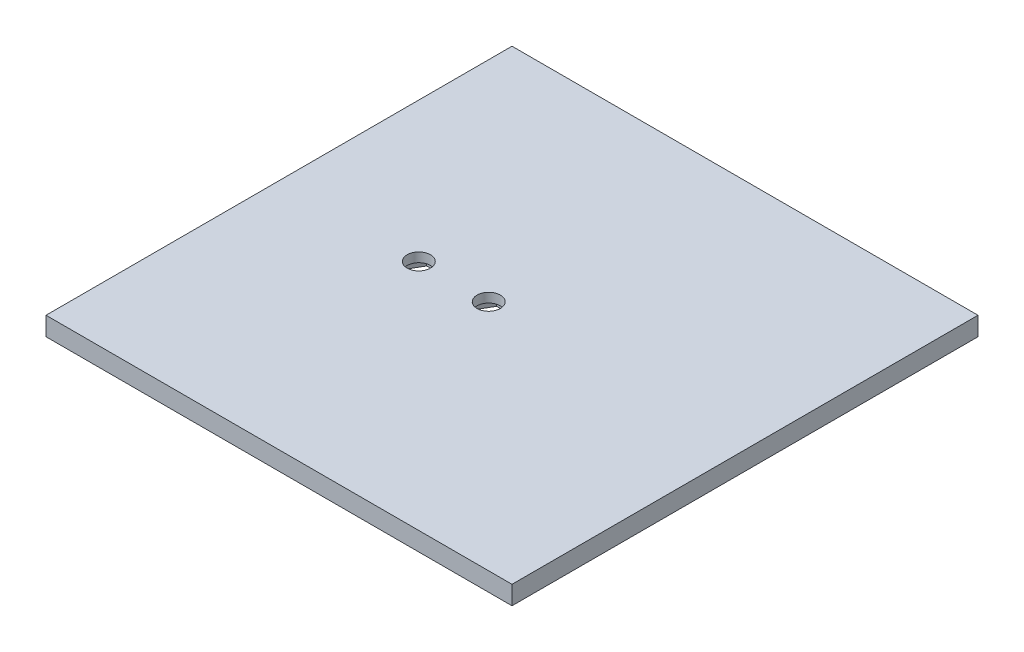
ISO-10303-21;
HEADER;
FILE_DESCRIPTION(('STEP AP214'),'2;1');
FILE_NAME('part.step','',(''),(''),'','','');
FILE_SCHEMA(('AUTOMOTIVE_DESIGN { 1 0 10303 214 1 1 1 1 }'));
ENDSEC;
DATA;
#1=APPLICATION_CONTEXT('core data for automotive mechanical design processes');
#2=APPLICATION_PROTOCOL_DEFINITION('international standard','automotive_design',2000,#1);
#3=PRODUCT_CONTEXT('',#1,'mechanical');
#4=PRODUCT('Part','Part','',(#3));
#5=PRODUCT_RELATED_PRODUCT_CATEGORY('part','',(#4));
#6=PRODUCT_DEFINITION_FORMATION('','',#4);
#7=PRODUCT_DEFINITION_CONTEXT('part definition',#1,'design');
#8=PRODUCT_DEFINITION('design','',#6,#7);
#9=PRODUCT_DEFINITION_SHAPE('','',#8);
#10=(LENGTH_UNIT() NAMED_UNIT(*) SI_UNIT(.MILLI.,.METRE.));
#11=(NAMED_UNIT(*) PLANE_ANGLE_UNIT() SI_UNIT($,.RADIAN.));
#12=(NAMED_UNIT(*) SI_UNIT($,.STERADIAN.) SOLID_ANGLE_UNIT());
#13=UNCERTAINTY_MEASURE_WITH_UNIT(LENGTH_MEASURE(1.E-05),#10,'distance_accuracy_value','');
#14=(GEOMETRIC_REPRESENTATION_CONTEXT(3) GLOBAL_UNCERTAINTY_ASSIGNED_CONTEXT((#13)) GLOBAL_UNIT_ASSIGNED_CONTEXT((#10,
#11,#12)) REPRESENTATION_CONTEXT('',''));
#15=CARTESIAN_POINT('',(0.,0.,0.));
#16=DIRECTION('',(0.,0.,1.));
#17=DIRECTION('',(1.,0.,0.));
#18=AXIS2_PLACEMENT_3D('',#15,#16,#17);
#19=CARTESIAN_POINT('',(-34.8765432098765,4.,-23.5339506172839));
#20=DIRECTION('',(1.,0.,0.));
#21=DIRECTION('',(0.,0.,-1.));
#22=AXIS2_PLACEMENT_3D('',#19,#20,#21);
#23=PLANE('',#22);
#24=DIRECTION('',(0.,0.,1.));
#25=VECTOR('',#24,1.);
#26=CARTESIAN_POINT('',(-34.8765432098765,0.,-23.5339506172839));
#27=LINE('',#26,#25);
#28=CARTESIAN_POINT('',(-34.8765432098765,0.,-23.5339506172839));
#29=VERTEX_POINT('',#28);
#30=CARTESIAN_POINT('',(-34.8765432098765,0.,76.4660493827161));
#31=VERTEX_POINT('',#30);
#32=EDGE_CURVE('E302',#29,#31,#27,.T.);
#33=ORIENTED_EDGE('',*,*,#32,.T.);
#34=DIRECTION('',(0.,-1.,0.));
#35=VECTOR('',#34,1.);
#36=CARTESIAN_POINT('',(-34.8765432098765,4.,76.4660493827161));
#37=LINE('',#36,#35);
#38=CARTESIAN_POINT('',(-34.8765432098765,4.,76.4660493827161));
#39=VERTEX_POINT('',#38);
#40=EDGE_CURVE('E11',#39,#31,#37,.T.);
#41=ORIENTED_EDGE('',*,*,#40,.F.);
#42=DIRECTION('',(0.,0.,1.));
#43=VECTOR('',#42,1.);
#44=CARTESIAN_POINT('',(-34.8765432098765,4.,-23.5339506172839));
#45=LINE('',#44,#43);
#46=CARTESIAN_POINT('',(-34.8765432098765,4.,-23.5339506172839));
#47=VERTEX_POINT('',#46);
#48=EDGE_CURVE('E310',#47,#39,#45,.T.);
#49=ORIENTED_EDGE('',*,*,#48,.F.);
#50=DIRECTION('',(0.,-1.,0.));
#51=VECTOR('',#50,1.);
#52=CARTESIAN_POINT('',(-34.8765432098765,4.,-23.5339506172839));
#53=LINE('',#52,#51);
#54=EDGE_CURVE('E324',#47,#29,#53,.T.);
#55=ORIENTED_EDGE('',*,*,#54,.T.);
#56=EDGE_LOOP('',(#33,#41,#49,#55));
#57=FACE_BOUND('',#56,.T.);
#58=ADVANCED_FACE('F43',(#57),#23,.F.);
#59=CARTESIAN_POINT('',(-34.8765432098765,4.,76.4660493827161));
#60=DIRECTION('',(0.,0.,-1.));
#61=DIRECTION('',(-1.,0.,0.));
#62=AXIS2_PLACEMENT_3D('',#59,#60,#61);
#63=PLANE('',#62);
#64=DIRECTION('',(1.,0.,0.));
#65=VECTOR('',#64,1.);
#66=CARTESIAN_POINT('',(-34.8765432098765,0.,76.4660493827161));
#67=LINE('',#66,#65);
#68=CARTESIAN_POINT('',(65.1234567901235,0.,76.4660493827161));
#69=VERTEX_POINT('',#68);
#70=EDGE_CURVE('E328',#31,#69,#67,.T.);
#71=ORIENTED_EDGE('',*,*,#70,.T.);
#72=DIRECTION('',(0.,-1.,0.));
#73=VECTOR('',#72,1.);
#74=CARTESIAN_POINT('',(65.1234567901235,4.,76.4660493827161));
#75=LINE('',#74,#73);
#76=CARTESIAN_POINT('',(65.1234567901235,4.,76.4660493827161));
#77=VERTEX_POINT('',#76);
#78=EDGE_CURVE('E51',#77,#69,#75,.T.);
#79=ORIENTED_EDGE('',*,*,#78,.F.);
#80=DIRECTION('',(1.,0.,0.));
#81=VECTOR('',#80,1.);
#82=CARTESIAN_POINT('',(-34.8765432098765,4.,76.4660493827161));
#83=LINE('',#82,#81);
#84=EDGE_CURVE('E314',#39,#77,#83,.T.);
#85=ORIENTED_EDGE('',*,*,#84,.F.);
#86=ORIENTED_EDGE('',*,*,#40,.T.);
#87=EDGE_LOOP('',(#71,#79,#85,#86));
#88=FACE_BOUND('',#87,.T.);
#89=ADVANCED_FACE('F364',(#88),#63,.F.);
#90=CARTESIAN_POINT('',(65.1234567901235,4.,-23.5339506172839));
#91=DIRECTION('',(-1.,0.,0.));
#92=DIRECTION('',(0.,0.,1.));
#93=AXIS2_PLACEMENT_3D('',#90,#91,#92);
#94=PLANE('',#93);
#95=DIRECTION('',(0.,0.,-1.));
#96=VECTOR('',#95,1.);
#97=CARTESIAN_POINT('',(65.1234567901235,0.,-23.5339506172839));
#98=LINE('',#97,#96);
#99=CARTESIAN_POINT('',(65.1234567901235,0.,-23.5339506172839));
#100=VERTEX_POINT('',#99);
#101=EDGE_CURVE('E331',#69,#100,#98,.T.);
#102=ORIENTED_EDGE('',*,*,#101,.T.);
#103=DIRECTION('',(0.,-1.,0.));
#104=VECTOR('',#103,1.);
#105=CARTESIAN_POINT('',(65.1234567901235,4.,-23.5339506172839));
#106=LINE('',#105,#104);
#107=CARTESIAN_POINT('',(65.1234567901235,4.,-23.5339506172839));
#108=VERTEX_POINT('',#107);
#109=EDGE_CURVE('E339',#108,#100,#106,.T.);
#110=ORIENTED_EDGE('',*,*,#109,.F.);
#111=DIRECTION('',(0.,0.,-1.));
#112=VECTOR('',#111,1.);
#113=CARTESIAN_POINT('',(65.1234567901235,4.,-23.5339506172839));
#114=LINE('',#113,#112);
#115=EDGE_CURVE('E318',#77,#108,#114,.T.);
#116=ORIENTED_EDGE('',*,*,#115,.F.);
#117=ORIENTED_EDGE('',*,*,#78,.T.);
#118=EDGE_LOOP('',(#102,#110,#116,#117));
#119=FACE_BOUND('',#118,.T.);
#120=ADVANCED_FACE('F348',(#119),#94,.F.);
#121=CARTESIAN_POINT('',(-34.8765432098765,4.,-23.5339506172839));
#122=DIRECTION('',(0.,0.,1.));
#123=DIRECTION('',(1.,0.,0.));
#124=AXIS2_PLACEMENT_3D('',#121,#122,#123);
#125=PLANE('',#124);
#126=DIRECTION('',(-1.,0.,0.));
#127=VECTOR('',#126,1.);
#128=CARTESIAN_POINT('',(-34.8765432098765,0.,-23.5339506172839));
#129=LINE('',#128,#127);
#130=EDGE_CURVE('E315',#100,#29,#129,.T.);
#131=ORIENTED_EDGE('',*,*,#130,.T.);
#132=ORIENTED_EDGE('',*,*,#54,.F.);
#133=DIRECTION('',(-1.,0.,0.));
#134=VECTOR('',#133,1.);
#135=CARTESIAN_POINT('',(-34.8765432098765,4.,-23.5339506172839));
#136=LINE('',#135,#134);
#137=EDGE_CURVE('E321',#108,#47,#136,.T.);
#138=ORIENTED_EDGE('',*,*,#137,.F.);
#139=ORIENTED_EDGE('',*,*,#109,.T.);
#140=EDGE_LOOP('',(#131,#132,#138,#139));
#141=FACE_BOUND('',#140,.T.);
#142=ADVANCED_FACE('F357',(#141),#125,.F.);
#143=CARTESIAN_POINT('',(0.,4.,0.));
#144=DIRECTION('',(0.,1.,0.));
#145=DIRECTION('',(0.,0.,1.));
#146=AXIS2_PLACEMENT_3D('',#143,#144,#145);
#147=PLANE('',#146);
#148=CARTESIAN_POINT('',(10.1234567901235,4.,26.4660493827161));
#149=DIRECTION('',(0.,1.,0.));
#150=DIRECTION('',(0.,0.,1.));
#151=AXIS2_PLACEMENT_3D('',#148,#149,#150);
#152=CIRCLE('',#151,2.5);
#153=CARTESIAN_POINT('',(10.1234567901235,4.,28.9660493827161));
#154=VERTEX_POINT('',#153);
#155=EDGE_CURVE('E298',#154,#154,#152,.T.);
#156=ORIENTED_EDGE('',*,*,#155,.F.);
#157=EDGE_LOOP('',(#156));
#158=FACE_BOUND('',#157,.T.);
#159=CARTESIAN_POINT('',(-4.87654320987654,4.,26.4660493827161));
#160=DIRECTION('',(0.,1.,0.));
#161=DIRECTION('',(0.,0.,1.));
#162=AXIS2_PLACEMENT_3D('',#159,#160,#161);
#163=CIRCLE('',#162,2.5);
#164=CARTESIAN_POINT('',(-4.87654320987654,4.,28.9660493827161));
#165=VERTEX_POINT('',#164);
#166=EDGE_CURVE('E303',#165,#165,#163,.T.);
#167=ORIENTED_EDGE('',*,*,#166,.F.);
#168=EDGE_LOOP('',(#167));
#169=FACE_BOUND('',#168,.T.);
#170=ORIENTED_EDGE('',*,*,#48,.T.);
#171=ORIENTED_EDGE('',*,*,#84,.T.);
#172=ORIENTED_EDGE('',*,*,#115,.T.);
#173=ORIENTED_EDGE('',*,*,#137,.T.);
#174=EDGE_LOOP('',(#170,#171,#172,#173));
#175=FACE_BOUND('',#174,.T.);
#176=ADVANCED_FACE('F363',(#158,#169,#175),#147,.T.);
#177=CARTESIAN_POINT('',(0.,0.,0.));
#178=DIRECTION('',(0.,1.,0.));
#179=DIRECTION('',(0.,0.,1.));
#180=AXIS2_PLACEMENT_3D('',#177,#178,#179);
#181=PLANE('',#180);
#182=DIRECTION('',(-0.5,0.,0.866025403784439));
#183=VECTOR('',#182,1.);
#184=CARTESIAN_POINT('',(-0.257741056359532,0.,26.4660493827161));
#185=LINE('',#184,#183);
#186=CARTESIAN_POINT('',(-0.257741056359532,0.,26.4660493827161));
#187=VERTEX_POINT('',#186);
#188=CARTESIAN_POINT('',(-2.56714213311803,0.,30.4660493827161));
#189=VERTEX_POINT('',#188);
#190=EDGE_CURVE('E201',#187,#189,#185,.T.);
#191=ORIENTED_EDGE('',*,*,#190,.F.);
#192=DIRECTION('',(0.5,0.,0.866025403784439));
#193=VECTOR('',#192,1.);
#194=CARTESIAN_POINT('',(-2.56714213311804,0.,22.4660493827161));
#195=LINE('',#194,#193);
#196=CARTESIAN_POINT('',(-2.56714213311804,0.,22.4660493827161));
#197=VERTEX_POINT('',#196);
#198=EDGE_CURVE('E58',#197,#187,#195,.T.);
#199=ORIENTED_EDGE('',*,*,#198,.F.);
#200=DIRECTION('',(1.,0.,0.));
#201=VECTOR('',#200,1.);
#202=CARTESIAN_POINT('',(-7.18594428663504,0.,22.4660493827161));
#203=LINE('',#202,#201);
#204=CARTESIAN_POINT('',(-7.18594428663504,0.,22.4660493827161));
#205=VERTEX_POINT('',#204);
#206=EDGE_CURVE('E181',#205,#197,#203,.T.);
#207=ORIENTED_EDGE('',*,*,#206,.F.);
#208=DIRECTION('',(0.5,0.,-0.866025403784439));
#209=VECTOR('',#208,1.);
#210=CARTESIAN_POINT('',(-9.49534536339355,0.,26.4660493827161));
#211=LINE('',#210,#209);
#212=CARTESIAN_POINT('',(-9.49534536339355,0.,26.4660493827161));
#213=VERTEX_POINT('',#212);
#214=EDGE_CURVE('E185',#213,#205,#211,.T.);
#215=ORIENTED_EDGE('',*,*,#214,.F.);
#216=DIRECTION('',(-0.5,0.,-0.866025403784439));
#217=VECTOR('',#216,1.);
#218=CARTESIAN_POINT('',(-7.18594428663504,0.,30.4660493827161));
#219=LINE('',#218,#217);
#220=CARTESIAN_POINT('',(-7.18594428663504,0.,30.4660493827161));
#221=VERTEX_POINT('',#220);
#222=EDGE_CURVE('E208',#221,#213,#219,.T.);
#223=ORIENTED_EDGE('',*,*,#222,.F.);
#224=DIRECTION('',(-1.,0.,0.));
#225=VECTOR('',#224,1.);
#226=CARTESIAN_POINT('',(-2.56714213311803,0.,30.4660493827161));
#227=LINE('',#226,#225);
#228=EDGE_CURVE('E204',#189,#221,#227,.T.);
#229=ORIENTED_EDGE('',*,*,#228,.F.);
#230=EDGE_LOOP('',(#191,#199,#207,#215,#223,#229));
#231=FACE_BOUND('',#230,.T.);
#232=DIRECTION('',(-0.5,0.,0.866025403784439));
#233=VECTOR('',#232,1.);
#234=CARTESIAN_POINT('',(14.7422589436405,0.,26.4660493827161));
#235=LINE('',#234,#233);
#236=CARTESIAN_POINT('',(14.7422589436405,0.,26.4660493827161));
#237=VERTEX_POINT('',#236);
#238=CARTESIAN_POINT('',(12.432857866882,0.,30.4660493827161));
#239=VERTEX_POINT('',#238);
#240=EDGE_CURVE('E266',#237,#239,#235,.T.);
#241=ORIENTED_EDGE('',*,*,#240,.F.);
#242=DIRECTION('',(0.5,0.,0.866025403784439));
#243=VECTOR('',#242,1.);
#244=CARTESIAN_POINT('',(12.432857866882,0.,22.4660493827161));
#245=LINE('',#244,#243);
#246=CARTESIAN_POINT('',(12.432857866882,0.,22.4660493827161));
#247=VERTEX_POINT('',#246);
#248=EDGE_CURVE('E66',#247,#237,#245,.T.);
#249=ORIENTED_EDGE('',*,*,#248,.F.);
#250=DIRECTION('',(1.,0.,0.));
#251=VECTOR('',#250,1.);
#252=CARTESIAN_POINT('',(7.81405571336495,0.,22.4660493827161));
#253=LINE('',#252,#251);
#254=CARTESIAN_POINT('',(7.81405571336495,0.,22.4660493827161));
#255=VERTEX_POINT('',#254);
#256=EDGE_CURVE('E249',#255,#247,#253,.T.);
#257=ORIENTED_EDGE('',*,*,#256,.F.);
#258=DIRECTION('',(0.5,0.,-0.866025403784439));
#259=VECTOR('',#258,1.);
#260=CARTESIAN_POINT('',(5.50465463660645,0.,26.4660493827161));
#261=LINE('',#260,#259);
#262=CARTESIAN_POINT('',(5.50465463660645,0.,26.4660493827161));
#263=VERTEX_POINT('',#262);
#264=EDGE_CURVE('E253',#263,#255,#261,.T.);
#265=ORIENTED_EDGE('',*,*,#264,.F.);
#266=DIRECTION('',(-0.5,0.,-0.866025403784439));
#267=VECTOR('',#266,1.);
#268=CARTESIAN_POINT('',(7.81405571336495,0.,30.4660493827161));
#269=LINE('',#268,#267);
#270=CARTESIAN_POINT('',(7.81405571336495,0.,30.4660493827161));
#271=VERTEX_POINT('',#270);
#272=EDGE_CURVE('E258',#271,#263,#269,.T.);
#273=ORIENTED_EDGE('',*,*,#272,.F.);
#274=DIRECTION('',(-1.,0.,0.));
#275=VECTOR('',#274,1.);
#276=CARTESIAN_POINT('',(12.432857866882,0.,30.4660493827161));
#277=LINE('',#276,#275);
#278=EDGE_CURVE('E262',#239,#271,#277,.T.);
#279=ORIENTED_EDGE('',*,*,#278,.F.);
#280=EDGE_LOOP('',(#241,#249,#257,#265,#273,#279));
#281=FACE_BOUND('',#280,.T.);
#282=ORIENTED_EDGE('',*,*,#32,.F.);
#283=ORIENTED_EDGE('',*,*,#130,.F.);
#284=ORIENTED_EDGE('',*,*,#101,.F.);
#285=ORIENTED_EDGE('',*,*,#70,.F.);
#286=EDGE_LOOP('',(#282,#283,#284,#285));
#287=FACE_BOUND('',#286,.T.);
#288=ADVANCED_FACE('F354',(#231,#281,#287),#181,.F.);
#289=CARTESIAN_POINT('',(-4.87654320987654,2.,26.4660493827161));
#290=DIRECTION('',(0.,1.,0.));
#291=DIRECTION('',(0.,0.,1.));
#292=AXIS2_PLACEMENT_3D('',#289,#290,#291);
#293=CYLINDRICAL_SURFACE('',#292,2.5);
#294=CARTESIAN_POINT('',(-4.87654320987654,2.,26.4660493827161));
#295=DIRECTION('',(0.,1.,0.));
#296=DIRECTION('',(0.,0.,1.));
#297=AXIS2_PLACEMENT_3D('',#294,#295,#296);
#298=CIRCLE('',#297,2.5);
#299=CARTESIAN_POINT('',(-4.87654320987654,2.,28.9660493827161));
#300=VERTEX_POINT('',#299);
#301=EDGE_CURVE('E297',#300,#300,#298,.T.);
#302=ORIENTED_EDGE('',*,*,#301,.F.);
#303=EDGE_LOOP('',(#302));
#304=FACE_BOUND('',#303,.T.);
#305=ORIENTED_EDGE('',*,*,#166,.T.);
#306=EDGE_LOOP('',(#305));
#307=FACE_BOUND('',#306,.T.);
#308=ADVANCED_FACE('F376',(#304,#307),#293,.F.);
#309=CARTESIAN_POINT('',(10.1234567901235,2.,26.4660493827161));
#310=DIRECTION('',(0.,1.,0.));
#311=DIRECTION('',(0.,0.,1.));
#312=AXIS2_PLACEMENT_3D('',#309,#310,#311);
#313=CYLINDRICAL_SURFACE('',#312,2.5);
#314=CARTESIAN_POINT('',(10.1234567901235,2.,26.4660493827161));
#315=DIRECTION('',(0.,1.,0.));
#316=DIRECTION('',(0.,0.,1.));
#317=AXIS2_PLACEMENT_3D('',#314,#315,#316);
#318=CIRCLE('',#317,2.5);
#319=CARTESIAN_POINT('',(10.1234567901235,2.,28.9660493827161));
#320=VERTEX_POINT('',#319);
#321=EDGE_CURVE('E218',#320,#320,#318,.T.);
#322=ORIENTED_EDGE('',*,*,#321,.F.);
#323=EDGE_LOOP('',(#322));
#324=FACE_BOUND('',#323,.T.);
#325=ORIENTED_EDGE('',*,*,#155,.T.);
#326=EDGE_LOOP('',(#325));
#327=FACE_BOUND('',#326,.T.);
#328=ADVANCED_FACE('F383',(#324,#327),#313,.F.);
#329=CARTESIAN_POINT('',(0.,2.,0.));
#330=DIRECTION('',(0.,-1.,0.));
#331=DIRECTION('',(0.,0.,-1.));
#332=AXIS2_PLACEMENT_3D('',#329,#330,#331);
#333=PLANE('',#332);
#334=DIRECTION('',(0.5,0.,0.866025403784439));
#335=VECTOR('',#334,1.);
#336=CARTESIAN_POINT('',(12.432857866882,2.,22.4660493827161));
#337=LINE('',#336,#335);
#338=CARTESIAN_POINT('',(12.432857866882,2.,22.4660493827161));
#339=VERTEX_POINT('',#338);
#340=CARTESIAN_POINT('',(14.7422589436405,2.,26.4660493827161));
#341=VERTEX_POINT('',#340);
#342=EDGE_CURVE('E254',#339,#341,#337,.T.);
#343=ORIENTED_EDGE('',*,*,#342,.T.);
#344=DIRECTION('',(-0.5,0.,0.866025403784439));
#345=VECTOR('',#344,1.);
#346=CARTESIAN_POINT('',(14.7422589436405,2.,26.4660493827161));
#347=LINE('',#346,#345);
#348=CARTESIAN_POINT('',(12.432857866882,2.,30.4660493827161));
#349=VERTEX_POINT('',#348);
#350=EDGE_CURVE('E287',#341,#349,#347,.T.);
#351=ORIENTED_EDGE('',*,*,#350,.T.);
#352=DIRECTION('',(-1.,0.,0.));
#353=VECTOR('',#352,1.);
#354=CARTESIAN_POINT('',(12.432857866882,2.,30.4660493827161));
#355=LINE('',#354,#353);
#356=CARTESIAN_POINT('',(7.81405571336495,2.,30.4660493827161));
#357=VERTEX_POINT('',#356);
#358=EDGE_CURVE('E283',#349,#357,#355,.T.);
#359=ORIENTED_EDGE('',*,*,#358,.T.);
#360=DIRECTION('',(-0.5,0.,-0.866025403784439));
#361=VECTOR('',#360,1.);
#362=CARTESIAN_POINT('',(7.81405571336495,2.,30.4660493827161));
#363=LINE('',#362,#361);
#364=CARTESIAN_POINT('',(5.50465463660645,2.,26.4660493827161));
#365=VERTEX_POINT('',#364);
#366=EDGE_CURVE('E279',#357,#365,#363,.T.);
#367=ORIENTED_EDGE('',*,*,#366,.T.);
#368=DIRECTION('',(0.5,0.,-0.866025403784439));
#369=VECTOR('',#368,1.);
#370=CARTESIAN_POINT('',(5.50465463660645,2.,26.4660493827161));
#371=LINE('',#370,#369);
#372=CARTESIAN_POINT('',(7.81405571336495,2.,22.4660493827161));
#373=VERTEX_POINT('',#372);
#374=EDGE_CURVE('E275',#365,#373,#371,.T.);
#375=ORIENTED_EDGE('',*,*,#374,.T.);
#376=DIRECTION('',(1.,0.,0.));
#377=VECTOR('',#376,1.);
#378=CARTESIAN_POINT('',(7.81405571336495,2.,22.4660493827161));
#379=LINE('',#378,#377);
#380=EDGE_CURVE('E233',#373,#339,#379,.T.);
#381=ORIENTED_EDGE('',*,*,#380,.T.);
#382=EDGE_LOOP('',(#343,#351,#359,#367,#375,#381));
#383=FACE_BOUND('',#382,.T.);
#384=ORIENTED_EDGE('',*,*,#321,.T.);
#385=EDGE_LOOP('',(#384));
#386=FACE_BOUND('',#385,.T.);
#387=ADVANCED_FACE('F387',(#383,#386),#333,.T.);
#388=CARTESIAN_POINT('',(12.432857866882,2.,22.4660493827161));
#389=DIRECTION('',(0.866025403784439,0.,-0.5));
#390=DIRECTION('',(-0.5,0.,-0.866025403784439));
#391=AXIS2_PLACEMENT_3D('',#388,#389,#390);
#392=PLANE('',#391);
#393=ORIENTED_EDGE('',*,*,#248,.T.);
#394=DIRECTION('',(0.,-1.,0.));
#395=VECTOR('',#394,1.);
#396=CARTESIAN_POINT('',(14.7422589436405,2.,26.4660493827161));
#397=LINE('',#396,#395);
#398=EDGE_CURVE('E230',#341,#237,#397,.T.);
#399=ORIENTED_EDGE('',*,*,#398,.F.);
#400=ORIENTED_EDGE('',*,*,#342,.F.);
#401=DIRECTION('',(0.,-1.,0.));
#402=VECTOR('',#401,1.);
#403=CARTESIAN_POINT('',(12.432857866882,2.,22.4660493827161));
#404=LINE('',#403,#402);
#405=EDGE_CURVE('E246',#339,#247,#404,.T.);
#406=ORIENTED_EDGE('',*,*,#405,.T.);
#407=EDGE_LOOP('',(#393,#399,#400,#406));
#408=FACE_BOUND('',#407,.T.);
#409=ADVANCED_FACE('F391',(#408),#392,.F.);
#410=CARTESIAN_POINT('',(7.81405571336495,2.,22.4660493827161));
#411=DIRECTION('',(0.,0.,-1.));
#412=DIRECTION('',(-1.,0.,0.));
#413=AXIS2_PLACEMENT_3D('',#410,#411,#412);
#414=PLANE('',#413);
#415=ORIENTED_EDGE('',*,*,#256,.T.);
#416=ORIENTED_EDGE('',*,*,#405,.F.);
#417=ORIENTED_EDGE('',*,*,#380,.F.);
#418=DIRECTION('',(0.,-1.,0.));
#419=VECTOR('',#418,1.);
#420=CARTESIAN_POINT('',(7.81405571336495,2.,22.4660493827161));
#421=LINE('',#420,#419);
#422=EDGE_CURVE('E243',#373,#255,#421,.T.);
#423=ORIENTED_EDGE('',*,*,#422,.T.);
#424=EDGE_LOOP('',(#415,#416,#417,#423));
#425=FACE_BOUND('',#424,.T.);
#426=ADVANCED_FACE('F393',(#425),#414,.F.);
#427=CARTESIAN_POINT('',(5.50465463660645,2.,26.4660493827161));
#428=DIRECTION('',(-0.866025403784439,0.,-0.5));
#429=DIRECTION('',(-0.5,0.,0.866025403784439));
#430=AXIS2_PLACEMENT_3D('',#427,#428,#429);
#431=PLANE('',#430);
#432=ORIENTED_EDGE('',*,*,#264,.T.);
#433=ORIENTED_EDGE('',*,*,#422,.F.);
#434=ORIENTED_EDGE('',*,*,#374,.F.);
#435=DIRECTION('',(0.,-1.,0.));
#436=VECTOR('',#435,1.);
#437=CARTESIAN_POINT('',(5.50465463660645,2.,26.4660493827161));
#438=LINE('',#437,#436);
#439=EDGE_CURVE('E240',#365,#263,#438,.T.);
#440=ORIENTED_EDGE('',*,*,#439,.T.);
#441=EDGE_LOOP('',(#432,#433,#434,#440));
#442=FACE_BOUND('',#441,.T.);
#443=ADVANCED_FACE('F396',(#442),#431,.F.);
#444=CARTESIAN_POINT('',(7.81405571336495,2.,30.4660493827161));
#445=DIRECTION('',(-0.866025403784439,0.,0.5));
#446=DIRECTION('',(0.5,0.,0.866025403784439));
#447=AXIS2_PLACEMENT_3D('',#444,#445,#446);
#448=PLANE('',#447);
#449=ORIENTED_EDGE('',*,*,#272,.T.);
#450=ORIENTED_EDGE('',*,*,#439,.F.);
#451=ORIENTED_EDGE('',*,*,#366,.F.);
#452=DIRECTION('',(0.,-1.,0.));
#453=VECTOR('',#452,1.);
#454=CARTESIAN_POINT('',(7.81405571336495,2.,30.4660493827161));
#455=LINE('',#454,#453);
#456=EDGE_CURVE('E237',#357,#271,#455,.T.);
#457=ORIENTED_EDGE('',*,*,#456,.T.);
#458=EDGE_LOOP('',(#449,#450,#451,#457));
#459=FACE_BOUND('',#458,.T.);
#460=ADVANCED_FACE('F400',(#459),#448,.F.);
#461=CARTESIAN_POINT('',(12.432857866882,2.,30.4660493827161));
#462=DIRECTION('',(0.,0.,1.));
#463=DIRECTION('',(1.,0.,0.));
#464=AXIS2_PLACEMENT_3D('',#461,#462,#463);
#465=PLANE('',#464);
#466=ORIENTED_EDGE('',*,*,#278,.T.);
#467=ORIENTED_EDGE('',*,*,#456,.F.);
#468=ORIENTED_EDGE('',*,*,#358,.F.);
#469=DIRECTION('',(0.,-1.,0.));
#470=VECTOR('',#469,1.);
#471=CARTESIAN_POINT('',(12.432857866882,2.,30.4660493827161));
#472=LINE('',#471,#470);
#473=EDGE_CURVE('E234',#349,#239,#472,.T.);
#474=ORIENTED_EDGE('',*,*,#473,.T.);
#475=EDGE_LOOP('',(#466,#467,#468,#474));
#476=FACE_BOUND('',#475,.T.);
#477=ADVANCED_FACE('F404',(#476),#465,.F.);
#478=CARTESIAN_POINT('',(14.7422589436405,2.,26.4660493827161));
#479=DIRECTION('',(0.866025403784439,0.,0.5));
#480=DIRECTION('',(0.5,0.,-0.866025403784439));
#481=AXIS2_PLACEMENT_3D('',#478,#479,#480);
#482=PLANE('',#481);
#483=ORIENTED_EDGE('',*,*,#240,.T.);
#484=ORIENTED_EDGE('',*,*,#473,.F.);
#485=ORIENTED_EDGE('',*,*,#350,.F.);
#486=ORIENTED_EDGE('',*,*,#398,.T.);
#487=EDGE_LOOP('',(#483,#484,#485,#486));
#488=FACE_BOUND('',#487,.T.);
#489=ADVANCED_FACE('F408',(#488),#482,.F.);
#490=CARTESIAN_POINT('',(0.,2.,0.));
#491=DIRECTION('',(0.,-1.,0.));
#492=DIRECTION('',(0.,0.,-1.));
#493=AXIS2_PLACEMENT_3D('',#490,#491,#492);
#494=PLANE('',#493);
#495=DIRECTION('',(0.5,0.,0.866025403784439));
#496=VECTOR('',#495,1.);
#497=CARTESIAN_POINT('',(-2.56714213311804,2.,22.4660493827161));
#498=LINE('',#497,#496);
#499=CARTESIAN_POINT('',(-2.56714213311804,2.,22.4660493827161));
#500=VERTEX_POINT('',#499);
#501=CARTESIAN_POINT('',(-0.257741056359532,2.,26.4660493827161));
#502=VERTEX_POINT('',#501);
#503=EDGE_CURVE('E158',#500,#502,#498,.T.);
#504=ORIENTED_EDGE('',*,*,#503,.T.);
#505=DIRECTION('',(-0.5,0.,0.866025403784439));
#506=VECTOR('',#505,1.);
#507=CARTESIAN_POINT('',(-0.257741056359532,2.,26.4660493827161));
#508=LINE('',#507,#506);
#509=CARTESIAN_POINT('',(-2.56714213311803,2.,30.4660493827161));
#510=VERTEX_POINT('',#509);
#511=EDGE_CURVE('E168',#502,#510,#508,.T.);
#512=ORIENTED_EDGE('',*,*,#511,.T.);
#513=DIRECTION('',(-1.,0.,0.));
#514=VECTOR('',#513,1.);
#515=CARTESIAN_POINT('',(-2.56714213311803,2.,30.4660493827161));
#516=LINE('',#515,#514);
#517=CARTESIAN_POINT('',(-7.18594428663504,2.,30.4660493827161));
#518=VERTEX_POINT('',#517);
#519=EDGE_CURVE('E174',#510,#518,#516,.T.);
#520=ORIENTED_EDGE('',*,*,#519,.T.);
#521=DIRECTION('',(-0.5,0.,-0.866025403784439));
#522=VECTOR('',#521,1.);
#523=CARTESIAN_POINT('',(-7.18594428663504,2.,30.4660493827161));
#524=LINE('',#523,#522);
#525=CARTESIAN_POINT('',(-9.49534536339355,2.,26.4660493827161));
#526=VERTEX_POINT('',#525);
#527=EDGE_CURVE('E190',#518,#526,#524,.T.);
#528=ORIENTED_EDGE('',*,*,#527,.T.);
#529=DIRECTION('',(0.5,0.,-0.866025403784439));
#530=VECTOR('',#529,1.);
#531=CARTESIAN_POINT('',(-9.49534536339355,2.,26.4660493827161));
#532=LINE('',#531,#530);
#533=CARTESIAN_POINT('',(-7.18594428663504,2.,22.4660493827161));
#534=VERTEX_POINT('',#533);
#535=EDGE_CURVE('E194',#526,#534,#532,.T.);
#536=ORIENTED_EDGE('',*,*,#535,.T.);
#537=DIRECTION('',(1.,0.,0.));
#538=VECTOR('',#537,1.);
#539=CARTESIAN_POINT('',(-7.18594428663504,2.,22.4660493827161));
#540=LINE('',#539,#538);
#541=EDGE_CURVE('E165',#534,#500,#540,.T.);
#542=ORIENTED_EDGE('',*,*,#541,.T.);
#543=EDGE_LOOP('',(#504,#512,#520,#528,#536,#542));
#544=FACE_BOUND('',#543,.T.);
#545=ORIENTED_EDGE('',*,*,#301,.T.);
#546=EDGE_LOOP('',(#545));
#547=FACE_BOUND('',#546,.T.);
#548=ADVANCED_FACE('F176',(#544,#547),#494,.T.);
#549=CARTESIAN_POINT('',(-2.56714213311804,2.,22.4660493827161));
#550=DIRECTION('',(0.866025403784439,0.,-0.5));
#551=DIRECTION('',(-0.5,0.,-0.866025403784439));
#552=AXIS2_PLACEMENT_3D('',#549,#550,#551);
#553=PLANE('',#552);
#554=ORIENTED_EDGE('',*,*,#198,.T.);
#555=DIRECTION('',(0.,-1.,0.));
#556=VECTOR('',#555,1.);
#557=CARTESIAN_POINT('',(-0.257741056359532,2.,26.4660493827161));
#558=LINE('',#557,#556);
#559=EDGE_CURVE('E154',#502,#187,#558,.T.);
#560=ORIENTED_EDGE('',*,*,#559,.F.);
#561=ORIENTED_EDGE('',*,*,#503,.F.);
#562=DIRECTION('',(0.,-1.,0.));
#563=VECTOR('',#562,1.);
#564=CARTESIAN_POINT('',(-2.56714213311804,2.,22.4660493827161));
#565=LINE('',#564,#563);
#566=EDGE_CURVE('E215',#500,#197,#565,.T.);
#567=ORIENTED_EDGE('',*,*,#566,.T.);
#568=EDGE_LOOP('',(#554,#560,#561,#567));
#569=FACE_BOUND('',#568,.T.);
#570=ADVANCED_FACE('F156',(#569),#553,.F.);
#571=CARTESIAN_POINT('',(-7.18594428663504,2.,22.4660493827161));
#572=DIRECTION('',(0.,0.,-1.));
#573=DIRECTION('',(-1.,0.,0.));
#574=AXIS2_PLACEMENT_3D('',#571,#572,#573);
#575=PLANE('',#574);
#576=ORIENTED_EDGE('',*,*,#206,.T.);
#577=ORIENTED_EDGE('',*,*,#566,.F.);
#578=ORIENTED_EDGE('',*,*,#541,.F.);
#579=DIRECTION('',(0.,-1.,0.));
#580=VECTOR('',#579,1.);
#581=CARTESIAN_POINT('',(-7.18594428663504,2.,22.4660493827161));
#582=LINE('',#581,#580);
#583=EDGE_CURVE('E219',#534,#205,#582,.T.);
#584=ORIENTED_EDGE('',*,*,#583,.T.);
#585=EDGE_LOOP('',(#576,#577,#578,#584));
#586=FACE_BOUND('',#585,.T.);
#587=ADVANCED_FACE('F417',(#586),#575,.F.);
#588=CARTESIAN_POINT('',(-9.49534536339355,2.,26.4660493827161));
#589=DIRECTION('',(-0.866025403784439,0.,-0.5));
#590=DIRECTION('',(-0.5,0.,0.866025403784439));
#591=AXIS2_PLACEMENT_3D('',#588,#589,#590);
#592=PLANE('',#591);
#593=ORIENTED_EDGE('',*,*,#214,.T.);
#594=ORIENTED_EDGE('',*,*,#583,.F.);
#595=ORIENTED_EDGE('',*,*,#535,.F.);
#596=DIRECTION('',(0.,-1.,0.));
#597=VECTOR('',#596,1.);
#598=CARTESIAN_POINT('',(-9.49534536339355,2.,26.4660493827161));
#599=LINE('',#598,#597);
#600=EDGE_CURVE('E222',#526,#213,#599,.T.);
#601=ORIENTED_EDGE('',*,*,#600,.T.);
#602=EDGE_LOOP('',(#593,#594,#595,#601));
#603=FACE_BOUND('',#602,.T.);
#604=ADVANCED_FACE('F427',(#603),#592,.F.);
#605=CARTESIAN_POINT('',(-7.18594428663504,2.,30.4660493827161));
#606=DIRECTION('',(-0.866025403784439,0.,0.5));
#607=DIRECTION('',(0.5,0.,0.866025403784439));
#608=AXIS2_PLACEMENT_3D('',#605,#606,#607);
#609=PLANE('',#608);
#610=ORIENTED_EDGE('',*,*,#222,.T.);
#611=ORIENTED_EDGE('',*,*,#600,.F.);
#612=ORIENTED_EDGE('',*,*,#527,.F.);
#613=DIRECTION('',(0.,-1.,0.));
#614=VECTOR('',#613,1.);
#615=CARTESIAN_POINT('',(-7.18594428663504,2.,30.4660493827161));
#616=LINE('',#615,#614);
#617=EDGE_CURVE('E225',#518,#221,#616,.T.);
#618=ORIENTED_EDGE('',*,*,#617,.T.);
#619=EDGE_LOOP('',(#610,#611,#612,#618));
#620=FACE_BOUND('',#619,.T.);
#621=ADVANCED_FACE('F423',(#620),#609,.F.);
#622=CARTESIAN_POINT('',(-2.56714213311803,2.,30.4660493827161));
#623=DIRECTION('',(0.,0.,1.));
#624=DIRECTION('',(1.,0.,0.));
#625=AXIS2_PLACEMENT_3D('',#622,#623,#624);
#626=PLANE('',#625);
#627=ORIENTED_EDGE('',*,*,#228,.T.);
#628=ORIENTED_EDGE('',*,*,#617,.F.);
#629=ORIENTED_EDGE('',*,*,#519,.F.);
#630=DIRECTION('',(0.,-1.,0.));
#631=VECTOR('',#630,1.);
#632=CARTESIAN_POINT('',(-2.56714213311803,2.,30.4660493827161));
#633=LINE('',#632,#631);
#634=EDGE_CURVE('E164',#510,#189,#633,.T.);
#635=ORIENTED_EDGE('',*,*,#634,.T.);
#636=EDGE_LOOP('',(#627,#628,#629,#635));
#637=FACE_BOUND('',#636,.T.);
#638=ADVANCED_FACE('F420',(#637),#626,.F.);
#639=CARTESIAN_POINT('',(-0.257741056359532,2.,26.4660493827161));
#640=DIRECTION('',(0.866025403784439,0.,0.5));
#641=DIRECTION('',(0.5,0.,-0.866025403784439));
#642=AXIS2_PLACEMENT_3D('',#639,#640,#641);
#643=PLANE('',#642);
#644=ORIENTED_EDGE('',*,*,#190,.T.);
#645=ORIENTED_EDGE('',*,*,#634,.F.);
#646=ORIENTED_EDGE('',*,*,#511,.F.);
#647=ORIENTED_EDGE('',*,*,#559,.T.);
#648=EDGE_LOOP('',(#644,#645,#646,#647));
#649=FACE_BOUND('',#648,.T.);
#650=ADVANCED_FACE('F169',(#649),#643,.F.);
#651=CLOSED_SHELL('',(#58,#89,#120,#142,#176,#288,#308,#328,#387,#409,#426,#443,#460,#477,#489,
#548,#570,#587,#604,#621,#638,#650));
#652=MANIFOLD_SOLID_BREP('B2',#651);
#653=ADVANCED_BREP_SHAPE_REPRESENTATION('',(#18,#652),#14);
#654=SHAPE_DEFINITION_REPRESENTATION(#9,#653);
ENDSEC;
END-ISO-10303-21;
